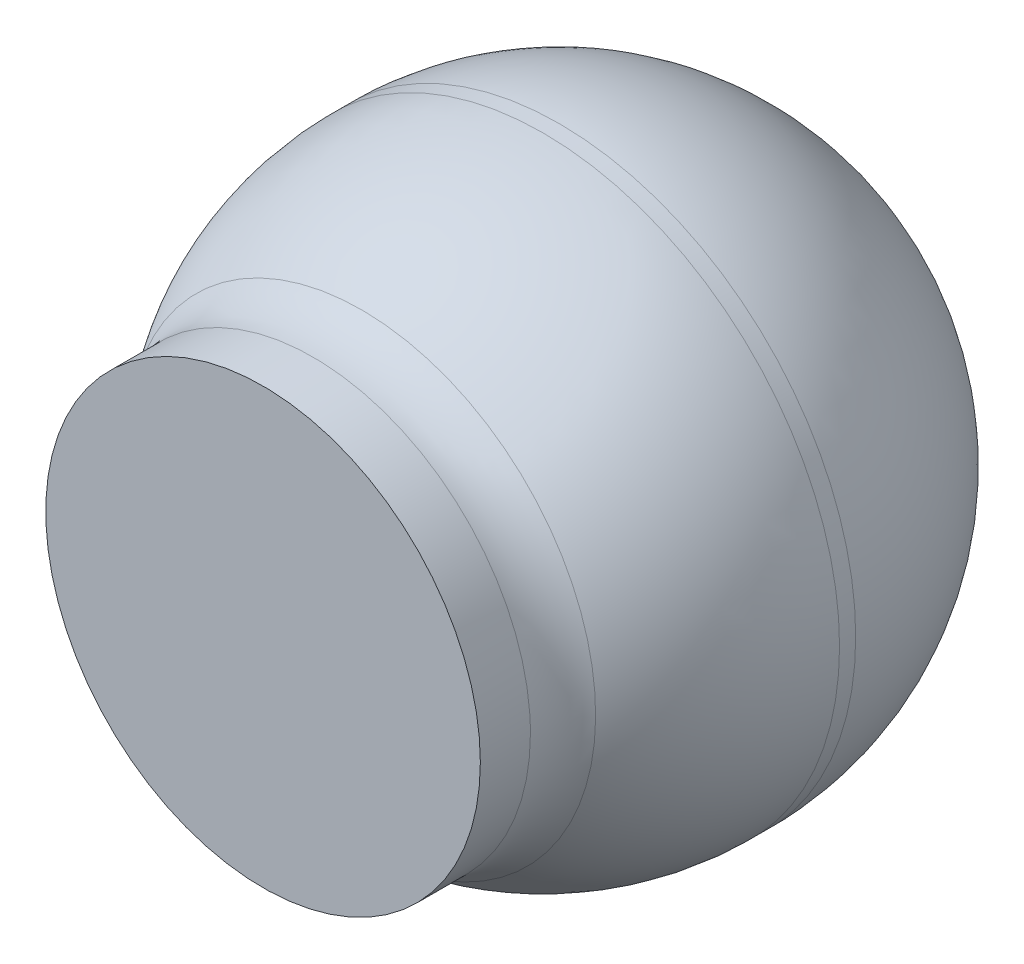
ISO-10303-21;
HEADER;
FILE_DESCRIPTION(('STEP AP214'),'2;1');
FILE_NAME('part.step','',(''),(''),'','','');
FILE_SCHEMA(('AUTOMOTIVE_DESIGN { 1 0 10303 214 1 1 1 1 }'));
ENDSEC;
DATA;
#1=APPLICATION_CONTEXT('core data for automotive mechanical design processes');
#2=APPLICATION_PROTOCOL_DEFINITION('international standard','automotive_design',2000,#1);
#3=PRODUCT_CONTEXT('',#1,'mechanical');
#4=PRODUCT('Part','Part','',(#3));
#5=PRODUCT_RELATED_PRODUCT_CATEGORY('part','',(#4));
#6=PRODUCT_DEFINITION_FORMATION('','',#4);
#7=PRODUCT_DEFINITION_CONTEXT('part definition',#1,'design');
#8=PRODUCT_DEFINITION('design','',#6,#7);
#9=PRODUCT_DEFINITION_SHAPE('','',#8);
#10=(LENGTH_UNIT() NAMED_UNIT(*) SI_UNIT(.MILLI.,.METRE.));
#11=(NAMED_UNIT(*) PLANE_ANGLE_UNIT() SI_UNIT($,.RADIAN.));
#12=(NAMED_UNIT(*) SI_UNIT($,.STERADIAN.) SOLID_ANGLE_UNIT());
#13=UNCERTAINTY_MEASURE_WITH_UNIT(LENGTH_MEASURE(1.E-05),#10,'distance_accuracy_value','');
#14=(GEOMETRIC_REPRESENTATION_CONTEXT(3) GLOBAL_UNCERTAINTY_ASSIGNED_CONTEXT((#13)) GLOBAL_UNIT_ASSIGNED_CONTEXT((#10,
#11,#12)) REPRESENTATION_CONTEXT('',''));
#15=CARTESIAN_POINT('',(0.,0.,0.));
#16=DIRECTION('',(0.,0.,1.));
#17=DIRECTION('',(1.,0.,0.));
#18=AXIS2_PLACEMENT_3D('',#15,#16,#17);
#19=CARTESIAN_POINT('',(-5.642919922269,-9.131349291452,10.006534503384));
#20=DIRECTION('',(0.,0.,-1.));
#21=DIRECTION('',(-1.,0.,0.));
#22=AXIS2_PLACEMENT_3D('',#19,#20,#21);
#23=PLANE('',#22);
#24=CARTESIAN_POINT('',(-5.642919922269,-9.131349291452,10.006534503384));
#25=DIRECTION('',(0.,0.,1.));
#26=DIRECTION('',(1.,0.,0.));
#27=AXIS2_PLACEMENT_3D('',#24,#25,#26);
#28=CIRCLE('',#27,0.275);
#29=CARTESIAN_POINT('',(-5.367919922269,-9.131349291452,10.006534503384));
#30=VERTEX_POINT('',#29);
#31=EDGE_CURVE('E20',#30,#30,#28,.F.);
#32=ORIENTED_EDGE('',*,*,#31,.F.);
#33=EDGE_LOOP('',(#32));
#34=FACE_BOUND('',#33,.T.);
#35=ADVANCED_FACE('F17',(#34),#23,.F.);
#36=CARTESIAN_POINT('',(-5.642919922269,-9.131349291452,9.906534503384));
#37=DIRECTION('',(0.,0.,1.));
#38=DIRECTION('',(1.,0.,0.));
#39=AXIS2_PLACEMENT_3D('',#36,#37,#38);
#40=CYLINDRICAL_SURFACE('',#39,0.275);
#41=CARTESIAN_POINT('',(-5.642919922269,-9.131349291452,9.943180457728));
#42=DIRECTION('',(0.,0.,-1.));
#43=DIRECTION('',(0.996700902337582,0.081162252799247,0.));
#44=AXIS2_PLACEMENT_3D('',#41,#42,#43);
#45=CIRCLE('',#44,0.275);
#46=CARTESIAN_POINT('',(-5.36882717412616,-9.10902967193221,9.943180457728));
#47=VERTEX_POINT('',#46);
#48=EDGE_CURVE('E65',#47,#47,#45,.F.);
#49=ORIENTED_EDGE('',*,*,#48,.T.);
#50=EDGE_LOOP('',(#49));
#51=FACE_BOUND('',#50,.T.);
#52=ORIENTED_EDGE('',*,*,#31,.T.);
#53=EDGE_LOOP('',(#52));
#54=FACE_BOUND('',#53,.T.);
#55=ADVANCED_FACE('F62',(#51,#54),#40,.T.);
#56=CARTESIAN_POINT('',(-5.642919922269,-9.131349291452,9.943180457728));
#57=DIRECTION('',(0.,0.,-1.));
#58=DIRECTION('',(0.996700902337583,0.0811622527992448,0.));
#59=AXIS2_PLACEMENT_3D('',#56,#57,#58);
#60=TOROIDAL_SURFACE('',#59,0.375,0.1);
#61=ORIENTED_EDGE('',*,*,#48,.F.);
#62=EDGE_LOOP('',(#61));
#63=FACE_BOUND('',#62,.T.);
#64=CARTESIAN_POINT('',(-5.642919922269,-9.131349291452,9.881744931236));
#65=DIRECTION('',(0.,0.,-1.));
#66=DIRECTION('',(-0.996700902337598,-0.081162252799062,0.));
#67=AXIS2_PLACEMENT_3D('',#64,#65,#66);
#68=CIRCLE('',#67,0.296097046412666);
#69=CARTESIAN_POINT('',(-5.938040115608,-9.155381194786,9.881744931236));
#70=VERTEX_POINT('',#69);
#71=EDGE_CURVE('E39',#70,#70,#68,.T.);
#72=ORIENTED_EDGE('',*,*,#71,.F.);
#73=EDGE_LOOP('',(#72));
#74=FACE_BOUND('',#73,.T.);
#75=ADVANCED_FACE('F57',(#63,#74),#60,.F.);
#76=CARTESIAN_POINT('',(-6.016682760645,-9.161785136252,9.651976062157));
#77=CARTESIAN_POINT('',(-6.016682760645,-9.161785136252,9.701461392103));
#78=CARTESIAN_POINT('',(-6.008526217348,-9.161120941579,9.750947004335));
#79=CARTESIAN_POINT('',(-5.992207085349,-9.159792059952,9.798626332798));
#80=CARTESIAN_POINT('',(-5.968341390838,-9.157848654938,9.842699544317));
#81=CARTESIAN_POINT('',(-5.938040115608,-9.155381194786,9.881744931236));
#82=(BOUNDED_CURVE() B_SPLINE_CURVE(5,(#76,#77,#78,#79,#80,#81),.UNSPECIFIED.,.F.,
.F.) B_SPLINE_CURVE_WITH_KNOTS((6,6),(0.,0.661568582165),
.UNSPECIFIED.) CURVE() GEOMETRIC_REPRESENTATION_ITEM() RATIONAL_B_SPLINE_CURVE((1.,1.,1.,1.,1.,1.)) REPRESENTATION_ITEM(''));
#83=CARTESIAN_POINT('',(-5.642919922269,-9.131349291452,9.651976062157));
#84=DIRECTION('',(0.,0.,-1.));
#85=AXIS1_PLACEMENT('',#83,#84);
#86=SURFACE_OF_REVOLUTION('',#82,#85);
#87=CARTESIAN_POINT('',(-5.642919922269,-9.131349291452,9.651976062157));
#88=DIRECTION('',(0.,0.,1.));
#89=DIRECTION('',(1.,0.,0.));
#90=AXIS2_PLACEMENT_3D('',#87,#88,#89);
#91=CIRCLE('',#90,0.375);
#92=CARTESIAN_POINT('',(-5.267919922269,-9.131349291452,9.651976062157));
#93=VERTEX_POINT('',#92);
#94=EDGE_CURVE('E36',#93,#93,#91,.F.);
#95=ORIENTED_EDGE('',*,*,#94,.F.);
#96=EDGE_LOOP('',(#95));
#97=FACE_BOUND('',#96,.T.);
#98=ORIENTED_EDGE('',*,*,#71,.T.);
#99=EDGE_LOOP('',(#98));
#100=FACE_BOUND('',#99,.T.);
#101=ADVANCED_FACE('F53',(#97,#100),#86,.F.);
#102=CARTESIAN_POINT('',(-5.642919922269,-9.131349291452,9.256534503384));
#103=DIRECTION('',(0.,0.,1.));
#104=DIRECTION('',(1.,0.,0.));
#105=AXIS2_PLACEMENT_3D('',#102,#103,#104);
#106=CYLINDRICAL_SURFACE('',#105,0.375);
#107=CARTESIAN_POINT('',(-5.642919922269,-9.131349291452,9.631534503384));
#108=DIRECTION('',(0.,0.,-1.));
#109=DIRECTION('',(0.0811622527992357,-0.996700902337583,0.));
#110=AXIS2_PLACEMENT_3D('',#107,#108,#109);
#111=CIRCLE('',#110,0.375);
#112=CARTESIAN_POINT('',(-5.61248407746929,-9.50511212982859,9.631534503384));
#113=VERTEX_POINT('',#112);
#114=CARTESIAN_POINT('',(-5.67335576706871,-8.75758645307541,9.631534503384));
#115=VERTEX_POINT('',#114);
#116=EDGE_CURVE('E11',#113,#115,#111,.T.);
#117=ORIENTED_EDGE('',*,*,#116,.F.);
#118=CARTESIAN_POINT('',(-5.642919922269,-9.131349291452,9.631534503384));
#119=DIRECTION('',(0.,0.,1.));
#120=DIRECTION('',(0.0811622527992365,-0.996700902337583,0.));
#121=AXIS2_PLACEMENT_3D('',#118,#119,#120);
#122=CIRCLE('',#121,0.375);
#123=EDGE_CURVE('E25',#115,#113,#122,.F.);
#124=ORIENTED_EDGE('',*,*,#123,.F.);
#125=EDGE_LOOP('',(#117,#124));
#126=FACE_BOUND('',#125,.T.);
#127=ORIENTED_EDGE('',*,*,#94,.T.);
#128=EDGE_LOOP('',(#127));
#129=FACE_BOUND('',#128,.T.);
#130=ADVANCED_FACE('F34',(#126,#129),#106,.T.);
#131=CARTESIAN_POINT('',(-5.642919922269,-9.131349291452,9.631534503384));
#132=DIRECTION('',(0.0811622527992361,-0.996700902337583,0.));
#133=DIRECTION('',(-0.996700902337583,-0.0811622527992361,0.));
#134=AXIS2_PLACEMENT_3D('',#131,#132,#133);
#135=SPHERICAL_SURFACE('',#134,0.375);
#136=ORIENTED_EDGE('',*,*,#123,.T.);
#137=ORIENTED_EDGE('',*,*,#116,.T.);
#138=EDGE_LOOP('',(#136,#137));
#139=FACE_BOUND('',#138,.T.);
#140=ADVANCED_FACE('F32',(#139),#135,.T.);
#141=CLOSED_SHELL('',(#35,#55,#75,#101,#130,#140));
#142=MANIFOLD_SOLID_BREP('B1',#141);
#143=ADVANCED_BREP_SHAPE_REPRESENTATION('',(#18,#142),#14);
#144=SHAPE_DEFINITION_REPRESENTATION(#9,#143);
ENDSEC;
END-ISO-10303-21;
